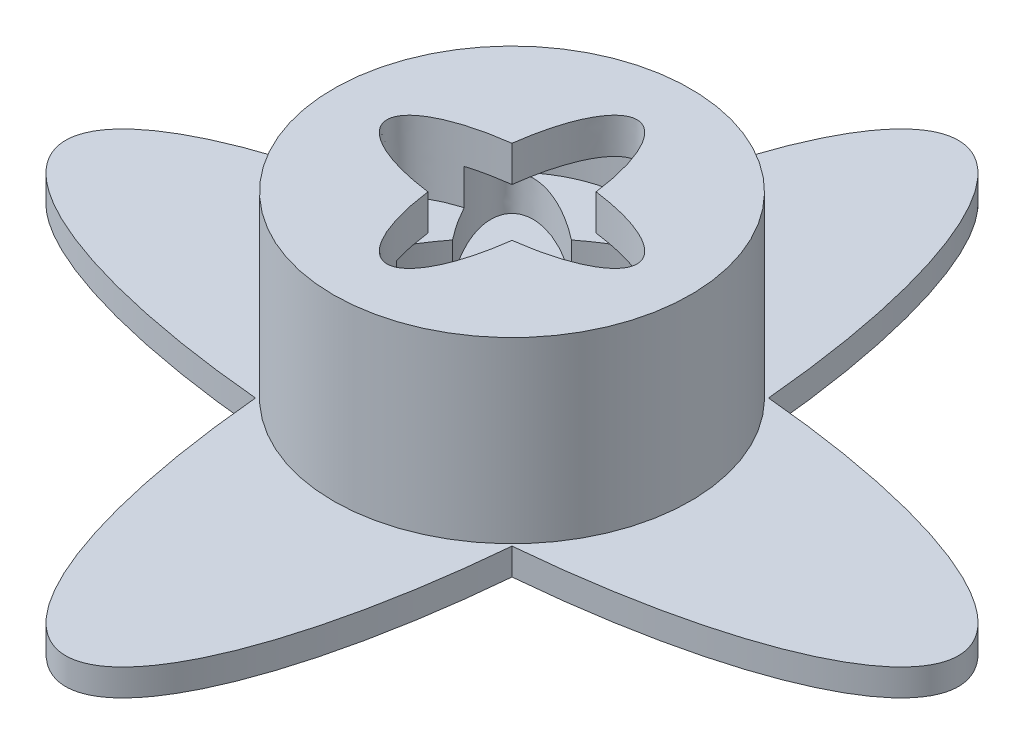
ISO-10303-21;
HEADER;
FILE_DESCRIPTION(('STEP AP214'),'2;1');
FILE_NAME('part.step','',(''),(''),'','','');
FILE_SCHEMA(('AUTOMOTIVE_DESIGN { 1 0 10303 214 1 1 1 1 }'));
ENDSEC;
DATA;
#1=APPLICATION_CONTEXT('core data for automotive mechanical design processes');
#2=APPLICATION_PROTOCOL_DEFINITION('international standard','automotive_design',2000,#1);
#3=PRODUCT_CONTEXT('',#1,'mechanical');
#4=PRODUCT('Part','Part','',(#3));
#5=PRODUCT_RELATED_PRODUCT_CATEGORY('part','',(#4));
#6=PRODUCT_DEFINITION_FORMATION('','',#4);
#7=PRODUCT_DEFINITION_CONTEXT('part definition',#1,'design');
#8=PRODUCT_DEFINITION('design','',#6,#7);
#9=PRODUCT_DEFINITION_SHAPE('','',#8);
#10=(LENGTH_UNIT() NAMED_UNIT(*) SI_UNIT(.MILLI.,.METRE.));
#11=(NAMED_UNIT(*) PLANE_ANGLE_UNIT() SI_UNIT($,.RADIAN.));
#12=(NAMED_UNIT(*) SI_UNIT($,.STERADIAN.) SOLID_ANGLE_UNIT());
#13=UNCERTAINTY_MEASURE_WITH_UNIT(LENGTH_MEASURE(1.E-05),#10,'distance_accuracy_value','');
#14=(GEOMETRIC_REPRESENTATION_CONTEXT(3) GLOBAL_UNCERTAINTY_ASSIGNED_CONTEXT((#13)) GLOBAL_UNIT_ASSIGNED_CONTEXT((#10,
#11,#12)) REPRESENTATION_CONTEXT('',''));
#15=CARTESIAN_POINT('',(0.,0.,0.));
#16=DIRECTION('',(0.,0.,1.));
#17=DIRECTION('',(1.,0.,0.));
#18=AXIS2_PLACEMENT_3D('',#15,#16,#17);
#19=CARTESIAN_POINT('',(0.,7.5,0.));
#20=DIRECTION('',(0.,1.,0.));
#21=DIRECTION('',(0.,0.,1.));
#22=AXIS2_PLACEMENT_3D('',#19,#20,#21);
#23=PLANE('',#22);
#24=CARTESIAN_POINT('',(0.,7.5,0.));
#25=DIRECTION('',(0.,1.,0.));
#26=DIRECTION('',(-0.707106781186544,0.,-0.707106781186551));
#27=AXIS2_PLACEMENT_3D('',#24,#25,#26);
#28=ELLIPSE('',#27,7.,2.5);
#29=CARTESIAN_POINT('',(4.57103403054583,7.5,1.89338428952106));
#30=VERTEX_POINT('',#29);
#31=CARTESIAN_POINT('',(3.32956045908145,7.5,0.));
#32=VERTEX_POINT('',#31);
#33=EDGE_CURVE('E11',#30,#32,#28,.T.);
#34=ORIENTED_EDGE('',*,*,#33,.F.);
#35=CARTESIAN_POINT('',(0.,7.5,0.));
#36=DIRECTION('',(0.,1.,0.));
#37=DIRECTION('',(-1.,0.,0.));
#38=AXIS2_PLACEMENT_3D('',#35,#36,#37);
#39=ELLIPSE('',#38,7.,2.5);
#40=CARTESIAN_POINT('',(7.,7.5,0.));
#41=VERTEX_POINT('',#40);
#42=EDGE_CURVE('E284',#30,#41,#39,.T.);
#43=ORIENTED_EDGE('',*,*,#42,.T.);
#44=CARTESIAN_POINT('',(0.,7.5,0.));
#45=DIRECTION('',(0.,1.,0.));
#46=DIRECTION('',(0.,0.,1.));
#47=AXIS2_PLACEMENT_3D('',#44,#45,#46);
#48=CIRCLE('',#47,7.);
#49=CARTESIAN_POINT('',(4.94974746830584,7.5,-4.94974746830583));
#50=VERTEX_POINT('',#49);
#51=EDGE_CURVE('E246',#41,#50,#48,.T.);
#52=ORIENTED_EDGE('',*,*,#51,.T.);
#53=CARTESIAN_POINT('',(0.,7.5,0.));
#54=DIRECTION('',(0.,1.,0.));
#55=DIRECTION('',(-0.707106781186549,0.,0.707106781186546));
#56=AXIS2_PLACEMENT_3D('',#53,#54,#55);
#57=ELLIPSE('',#56,7.,2.5);
#58=EDGE_CURVE('E232',#32,#50,#57,.T.);
#59=ORIENTED_EDGE('',*,*,#58,.F.);
#60=EDGE_LOOP('',(#34,#43,#52,#59));
#61=FACE_BOUND('',#60,.T.);
#62=ADVANCED_FACE('F33',(#61),#23,.T.);
#63=CARTESIAN_POINT('',(1.89338428952104,7.5,-4.57103403054583));
#64=VERTEX_POINT('',#63);
#65=CARTESIAN_POINT('',(0.,7.5,-3.32956045908146));
#66=VERTEX_POINT('',#65);
#67=EDGE_CURVE('E43',#64,#66,#57,.T.);
#68=ORIENTED_EDGE('',*,*,#67,.F.);
#69=CARTESIAN_POINT('',(0.,7.5,0.));
#70=DIRECTION('',(0.,1.,0.));
#71=DIRECTION('',(0.,0.,1.));
#72=AXIS2_PLACEMENT_3D('',#69,#70,#71);
#73=ELLIPSE('',#72,7.,2.5);
#74=CARTESIAN_POINT('',(0.,7.5,-7.));
#75=VERTEX_POINT('',#74);
#76=EDGE_CURVE('E280',#64,#75,#73,.T.);
#77=ORIENTED_EDGE('',*,*,#76,.T.);
#78=CARTESIAN_POINT('',(0.,7.5,0.));
#79=DIRECTION('',(0.,1.,0.));
#80=DIRECTION('',(0.,0.,1.));
#81=AXIS2_PLACEMENT_3D('',#78,#79,#80);
#82=CIRCLE('',#81,7.);
#83=CARTESIAN_POINT('',(-4.94974746830581,7.5,-4.94974746830586));
#84=VERTEX_POINT('',#83);
#85=EDGE_CURVE('E238',#75,#84,#82,.T.);
#86=ORIENTED_EDGE('',*,*,#85,.T.);
#87=CARTESIAN_POINT('',(0.,7.5,0.));
#88=DIRECTION('',(0.,1.,0.));
#89=DIRECTION('',(-0.707106781186544,0.,-0.707106781186551));
#90=AXIS2_PLACEMENT_3D('',#87,#88,#89);
#91=ELLIPSE('',#90,7.,2.5);
#92=EDGE_CURVE('E227',#66,#84,#91,.T.);
#93=ORIENTED_EDGE('',*,*,#92,.F.);
#94=EDGE_LOOP('',(#68,#77,#86,#93));
#95=FACE_BOUND('',#94,.T.);
#96=ADVANCED_FACE('F380',(#95),#23,.T.);
#97=CARTESIAN_POINT('',(-4.57103403054582,7.5,-1.89338428952106));
#98=VERTEX_POINT('',#97);
#99=CARTESIAN_POINT('',(-3.32956045908145,7.5,0.));
#100=VERTEX_POINT('',#99);
#101=EDGE_CURVE('E234',#98,#100,#91,.T.);
#102=ORIENTED_EDGE('',*,*,#101,.F.);
#103=CARTESIAN_POINT('',(0.,7.5,0.));
#104=DIRECTION('',(0.,1.,0.));
#105=DIRECTION('',(-1.,0.,0.));
#106=AXIS2_PLACEMENT_3D('',#103,#104,#105);
#107=ELLIPSE('',#106,7.,2.5);
#108=CARTESIAN_POINT('',(-7.,7.5,0.));
#109=VERTEX_POINT('',#108);
#110=EDGE_CURVE('E298',#98,#109,#107,.T.);
#111=ORIENTED_EDGE('',*,*,#110,.T.);
#112=CARTESIAN_POINT('',(0.,7.5,0.));
#113=DIRECTION('',(0.,1.,0.));
#114=DIRECTION('',(0.,0.,1.));
#115=AXIS2_PLACEMENT_3D('',#112,#113,#114);
#116=CIRCLE('',#115,7.);
#117=CARTESIAN_POINT('',(-4.94974746830584,7.5,4.94974746830582));
#118=VERTEX_POINT('',#117);
#119=EDGE_CURVE('E384',#109,#118,#116,.T.);
#120=ORIENTED_EDGE('',*,*,#119,.T.);
#121=CARTESIAN_POINT('',(0.,7.5,0.));
#122=DIRECTION('',(0.,1.,0.));
#123=DIRECTION('',(-0.707106781186549,0.,0.707106781186546));
#124=AXIS2_PLACEMENT_3D('',#121,#122,#123);
#125=ELLIPSE('',#124,7.,2.5);
#126=EDGE_CURVE('E225',#100,#118,#125,.T.);
#127=ORIENTED_EDGE('',*,*,#126,.F.);
#128=EDGE_LOOP('',(#102,#111,#120,#127));
#129=FACE_BOUND('',#128,.T.);
#130=ADVANCED_FACE('F270',(#129),#23,.T.);
#131=CARTESIAN_POINT('',(0.,1.5,0.));
#132=DIRECTION('',(0.,1.,0.));
#133=DIRECTION('',(-1.,0.,0.));
#134=AXIS2_PLACEMENT_3D('',#131,#132,#133);
#135=ELLIPSE('',#134,25.,7.5);
#136=DIRECTION('',(0.,-1.,0.));
#137=VECTOR('',#136,1.);
#138=SURFACE_OF_LINEAR_EXTRUSION('',#135,#137);
#139=CARTESIAN_POINT('',(0.,0.,0.));
#140=DIRECTION('',(0.,1.,0.));
#141=DIRECTION('',(-1.,0.,0.));
#142=AXIS2_PLACEMENT_3D('',#139,#140,#141);
#143=ELLIPSE('',#142,25.,7.5);
#144=CARTESIAN_POINT('',(7.18369713915863,0.,7.18369713915867));
#145=VERTEX_POINT('',#144);
#146=CARTESIAN_POINT('',(7.18369713915864,0.,-7.18369713915862));
#147=VERTEX_POINT('',#146);
#148=EDGE_CURVE('E316',#145,#147,#143,.T.);
#149=ORIENTED_EDGE('',*,*,#148,.T.);
#150=DIRECTION('',(0.,-1.,0.));
#151=VECTOR('',#150,1.);
#152=CARTESIAN_POINT('',(7.18369713915864,1.5,-7.18369713915862));
#153=LINE('',#152,#151);
#154=CARTESIAN_POINT('',(7.18369713915864,1.5,-7.18369713915862));
#155=VERTEX_POINT('',#154);
#156=EDGE_CURVE('E362',#155,#147,#153,.T.);
#157=ORIENTED_EDGE('',*,*,#156,.F.);
#158=CARTESIAN_POINT('',(7.18369713915863,1.5,7.18369713915867));
#159=VERTEX_POINT('',#158);
#160=EDGE_CURVE('E318',#159,#155,#135,.T.);
#161=ORIENTED_EDGE('',*,*,#160,.F.);
#162=DIRECTION('',(0.,-1.,0.));
#163=VECTOR('',#162,1.);
#164=CARTESIAN_POINT('',(7.18369713915863,1.5,7.18369713915867));
#165=LINE('',#164,#163);
#166=EDGE_CURVE('E347',#159,#145,#165,.T.);
#167=ORIENTED_EDGE('',*,*,#166,.T.);
#168=EDGE_LOOP('',(#149,#157,#161,#167));
#169=FACE_BOUND('',#168,.T.);
#170=ADVANCED_FACE('F35',(#169),#138,.F.);
#171=CARTESIAN_POINT('',(0.,1.5,0.));
#172=DIRECTION('',(0.,1.,0.));
#173=DIRECTION('',(0.,0.,1.));
#174=AXIS2_PLACEMENT_3D('',#171,#172,#173);
#175=ELLIPSE('',#174,25.,7.5);
#176=DIRECTION('',(0.,-1.,0.));
#177=VECTOR('',#176,1.);
#178=SURFACE_OF_LINEAR_EXTRUSION('',#175,#177);
#179=CARTESIAN_POINT('',(0.,0.,0.));
#180=DIRECTION('',(0.,1.,0.));
#181=DIRECTION('',(0.,0.,1.));
#182=AXIS2_PLACEMENT_3D('',#179,#180,#181);
#183=ELLIPSE('',#182,25.,7.5);
#184=CARTESIAN_POINT('',(-7.18369713915862,0.,-7.18369713915866));
#185=VERTEX_POINT('',#184);
#186=EDGE_CURVE('E350',#147,#185,#183,.T.);
#187=ORIENTED_EDGE('',*,*,#186,.T.);
#188=DIRECTION('',(0.,-1.,0.));
#189=VECTOR('',#188,1.);
#190=CARTESIAN_POINT('',(-7.18369713915862,1.5,-7.18369713915866));
#191=LINE('',#190,#189);
#192=CARTESIAN_POINT('',(-7.18369713915862,1.5,-7.18369713915866));
#193=VERTEX_POINT('',#192);
#194=EDGE_CURVE('E360',#193,#185,#191,.T.);
#195=ORIENTED_EDGE('',*,*,#194,.F.);
#196=EDGE_CURVE('E322',#155,#193,#175,.T.);
#197=ORIENTED_EDGE('',*,*,#196,.F.);
#198=ORIENTED_EDGE('',*,*,#156,.T.);
#199=EDGE_LOOP('',(#187,#195,#197,#198));
#200=FACE_BOUND('',#199,.T.);
#201=ADVANCED_FACE('F329',(#200),#178,.F.);
#202=CARTESIAN_POINT('',(0.,1.5,0.));
#203=DIRECTION('',(0.,1.,0.));
#204=DIRECTION('',(-1.,0.,0.));
#205=AXIS2_PLACEMENT_3D('',#202,#203,#204);
#206=ELLIPSE('',#205,25.,7.5);
#207=DIRECTION('',(0.,-1.,0.));
#208=VECTOR('',#207,1.);
#209=SURFACE_OF_LINEAR_EXTRUSION('',#206,#208);
#210=CARTESIAN_POINT('',(0.,0.,0.));
#211=DIRECTION('',(0.,1.,0.));
#212=DIRECTION('',(-1.,0.,0.));
#213=AXIS2_PLACEMENT_3D('',#210,#211,#212);
#214=ELLIPSE('',#213,25.,7.5);
#215=CARTESIAN_POINT('',(-7.18369713915864,0.,7.1836971391586));
#216=VERTEX_POINT('',#215);
#217=EDGE_CURVE('E352',#185,#216,#214,.T.);
#218=ORIENTED_EDGE('',*,*,#217,.T.);
#219=DIRECTION('',(0.,-1.,0.));
#220=VECTOR('',#219,1.);
#221=CARTESIAN_POINT('',(-7.18369713915864,1.5,7.1836971391586));
#222=LINE('',#221,#220);
#223=CARTESIAN_POINT('',(-7.18369713915864,1.5,7.1836971391586));
#224=VERTEX_POINT('',#223);
#225=EDGE_CURVE('E357',#224,#216,#222,.T.);
#226=ORIENTED_EDGE('',*,*,#225,.F.);
#227=EDGE_CURVE('E326',#193,#224,#206,.T.);
#228=ORIENTED_EDGE('',*,*,#227,.F.);
#229=ORIENTED_EDGE('',*,*,#194,.T.);
#230=EDGE_LOOP('',(#218,#226,#228,#229));
#231=FACE_BOUND('',#230,.T.);
#232=ADVANCED_FACE('F332',(#231),#209,.F.);
#233=CARTESIAN_POINT('',(0.,1.5,0.));
#234=DIRECTION('',(0.,1.,0.));
#235=DIRECTION('',(0.,0.,1.));
#236=AXIS2_PLACEMENT_3D('',#233,#234,#235);
#237=ELLIPSE('',#236,25.,7.5);
#238=DIRECTION('',(0.,-1.,0.));
#239=VECTOR('',#238,1.);
#240=SURFACE_OF_LINEAR_EXTRUSION('',#237,#239);
#241=CARTESIAN_POINT('',(0.,0.,0.));
#242=DIRECTION('',(0.,1.,0.));
#243=DIRECTION('',(0.,0.,1.));
#244=AXIS2_PLACEMENT_3D('',#241,#242,#243);
#245=ELLIPSE('',#244,25.,7.5);
#246=EDGE_CURVE('E323',#216,#145,#245,.T.);
#247=ORIENTED_EDGE('',*,*,#246,.T.);
#248=ORIENTED_EDGE('',*,*,#166,.F.);
#249=EDGE_CURVE('E344',#224,#159,#237,.T.);
#250=ORIENTED_EDGE('',*,*,#249,.F.);
#251=ORIENTED_EDGE('',*,*,#225,.T.);
#252=EDGE_LOOP('',(#247,#248,#250,#251));
#253=FACE_BOUND('',#252,.T.);
#254=ADVANCED_FACE('F336',(#253),#240,.F.);
#255=CARTESIAN_POINT('',(0.,1.5,0.));
#256=DIRECTION('',(0.,1.,0.));
#257=DIRECTION('',(0.,0.,1.));
#258=AXIS2_PLACEMENT_3D('',#255,#256,#257);
#259=PLANE('',#258);
#260=CARTESIAN_POINT('',(0.,1.5,0.));
#261=DIRECTION('',(0.,1.,0.));
#262=DIRECTION('',(0.,0.,1.));
#263=AXIS2_PLACEMENT_3D('',#260,#261,#262);
#264=CIRCLE('',#263,10.);
#265=CARTESIAN_POINT('',(0.,1.5,10.));
#266=VERTEX_POINT('',#265);
#267=EDGE_CURVE('E310',#266,#266,#264,.T.);
#268=ORIENTED_EDGE('',*,*,#267,.F.);
#269=EDGE_LOOP('',(#268));
#270=FACE_BOUND('',#269,.T.);
#271=ORIENTED_EDGE('',*,*,#160,.T.);
#272=ORIENTED_EDGE('',*,*,#196,.T.);
#273=ORIENTED_EDGE('',*,*,#227,.T.);
#274=ORIENTED_EDGE('',*,*,#249,.T.);
#275=EDGE_LOOP('',(#271,#272,#273,#274));
#276=FACE_BOUND('',#275,.T.);
#277=ADVANCED_FACE('F340',(#270,#276),#259,.T.);
#278=CARTESIAN_POINT('',(0.,0.,0.));
#279=DIRECTION('',(0.,1.,0.));
#280=DIRECTION('',(0.,0.,1.));
#281=AXIS2_PLACEMENT_3D('',#278,#279,#280);
#282=PLANE('',#281);
#283=CARTESIAN_POINT('',(0.,0.,0.));
#284=DIRECTION('',(0.,-1.,0.));
#285=DIRECTION('',(0.,0.,-1.));
#286=AXIS2_PLACEMENT_3D('',#283,#284,#285);
#287=CIRCLE('',#286,2.5);
#288=CARTESIAN_POINT('',(0.,0.,-2.5));
#289=VERTEX_POINT('',#288);
#290=EDGE_CURVE('E301',#289,#289,#287,.T.);
#291=ORIENTED_EDGE('',*,*,#290,.F.);
#292=EDGE_LOOP('',(#291));
#293=FACE_BOUND('',#292,.T.);
#294=ORIENTED_EDGE('',*,*,#148,.F.);
#295=ORIENTED_EDGE('',*,*,#246,.F.);
#296=ORIENTED_EDGE('',*,*,#217,.F.);
#297=ORIENTED_EDGE('',*,*,#186,.F.);
#298=EDGE_LOOP('',(#294,#295,#296,#297));
#299=FACE_BOUND('',#298,.T.);
#300=ADVANCED_FACE('F342',(#293,#299),#282,.F.);
#301=CARTESIAN_POINT('',(0.,11.5,0.));
#302=DIRECTION('',(0.,-1.,0.));
#303=DIRECTION('',(0.,0.,-1.));
#304=AXIS2_PLACEMENT_3D('',#301,#302,#303);
#305=CYLINDRICAL_SURFACE('',#304,10.);
#306=CARTESIAN_POINT('',(0.,11.5,0.));
#307=DIRECTION('',(0.,1.,0.));
#308=DIRECTION('',(0.,0.,1.));
#309=AXIS2_PLACEMENT_3D('',#306,#307,#308);
#310=CIRCLE('',#309,10.);
#311=CARTESIAN_POINT('',(0.,11.5,10.));
#312=VERTEX_POINT('',#311);
#313=EDGE_CURVE('E313',#312,#312,#310,.T.);
#314=ORIENTED_EDGE('',*,*,#313,.F.);
#315=EDGE_LOOP('',(#314));
#316=FACE_BOUND('',#315,.T.);
#317=ORIENTED_EDGE('',*,*,#267,.T.);
#318=EDGE_LOOP('',(#317));
#319=FACE_BOUND('',#318,.T.);
#320=ADVANCED_FACE('F426',(#316,#319),#305,.T.);
#321=CARTESIAN_POINT('',(0.,11.5,0.));
#322=DIRECTION('',(0.,1.,0.));
#323=DIRECTION('',(0.,0.,1.));
#324=AXIS2_PLACEMENT_3D('',#321,#322,#323);
#325=PLANE('',#324);
#326=CARTESIAN_POINT('',(0.,11.5,0.));
#327=DIRECTION('',(0.,1.,0.));
#328=DIRECTION('',(-1.,0.,0.));
#329=AXIS2_PLACEMENT_3D('',#326,#327,#328);
#330=ELLIPSE('',#329,7.,2.5);
#331=CARTESIAN_POINT('',(-2.35435477898709,11.5,-2.3543547789871));
#332=VERTEX_POINT('',#331);
#333=CARTESIAN_POINT('',(-2.3543547789871,11.5,2.35435477898708));
#334=VERTEX_POINT('',#333);
#335=EDGE_CURVE('E287',#332,#334,#330,.T.);
#336=ORIENTED_EDGE('',*,*,#335,.F.);
#337=CARTESIAN_POINT('',(0.,11.5,0.));
#338=DIRECTION('',(0.,1.,0.));
#339=DIRECTION('',(0.,0.,1.));
#340=AXIS2_PLACEMENT_3D('',#337,#338,#339);
#341=ELLIPSE('',#340,7.,2.5);
#342=CARTESIAN_POINT('',(2.3543547789871,11.5,-2.35435477898709));
#343=VERTEX_POINT('',#342);
#344=EDGE_CURVE('E295',#343,#332,#341,.T.);
#345=ORIENTED_EDGE('',*,*,#344,.F.);
#346=CARTESIAN_POINT('',(0.,11.5,0.));
#347=DIRECTION('',(0.,1.,0.));
#348=DIRECTION('',(-1.,0.,0.));
#349=AXIS2_PLACEMENT_3D('',#346,#347,#348);
#350=ELLIPSE('',#349,7.,2.5);
#351=CARTESIAN_POINT('',(2.35435477898709,11.5,2.3543547789871));
#352=VERTEX_POINT('',#351);
#353=EDGE_CURVE('E292',#352,#343,#350,.T.);
#354=ORIENTED_EDGE('',*,*,#353,.F.);
#355=CARTESIAN_POINT('',(0.,11.5,0.));
#356=DIRECTION('',(0.,1.,0.));
#357=DIRECTION('',(0.,0.,1.));
#358=AXIS2_PLACEMENT_3D('',#355,#356,#357);
#359=ELLIPSE('',#358,7.,2.5);
#360=EDGE_CURVE('E289',#334,#352,#359,.T.);
#361=ORIENTED_EDGE('',*,*,#360,.F.);
#362=EDGE_LOOP('',(#336,#345,#354,#361));
#363=FACE_BOUND('',#362,.T.);
#364=ORIENTED_EDGE('',*,*,#313,.T.);
#365=EDGE_LOOP('',(#364));
#366=FACE_BOUND('',#365,.T.);
#367=ADVANCED_FACE('F422',(#363,#366),#325,.T.);
#368=CARTESIAN_POINT('',(0.,2.5,0.));
#369=DIRECTION('',(0.,-1.,0.));
#370=DIRECTION('',(0.,0.,-1.));
#371=AXIS2_PLACEMENT_3D('',#368,#369,#370);
#372=CYLINDRICAL_SURFACE('',#371,2.5);
#373=CARTESIAN_POINT('',(0.,2.5,0.));
#374=DIRECTION('',(0.,-1.,0.));
#375=DIRECTION('',(0.,0.,-1.));
#376=AXIS2_PLACEMENT_3D('',#373,#374,#375);
#377=CIRCLE('',#376,2.5);
#378=CARTESIAN_POINT('',(0.,2.5,-2.5));
#379=VERTEX_POINT('',#378);
#380=EDGE_CURVE('E307',#379,#379,#377,.T.);
#381=ORIENTED_EDGE('',*,*,#380,.F.);
#382=EDGE_LOOP('',(#381));
#383=FACE_BOUND('',#382,.T.);
#384=ORIENTED_EDGE('',*,*,#290,.T.);
#385=EDGE_LOOP('',(#384));
#386=FACE_BOUND('',#385,.T.);
#387=ADVANCED_FACE('F418',(#383,#386),#372,.F.);
#388=CARTESIAN_POINT('',(0.,2.5,0.));
#389=DIRECTION('',(0.,-1.,0.));
#390=DIRECTION('',(0.,0.,-1.));
#391=AXIS2_PLACEMENT_3D('',#388,#389,#390);
#392=PLANE('',#391);
#393=ORIENTED_EDGE('',*,*,#380,.T.);
#394=EDGE_LOOP('',(#393));
#395=FACE_BOUND('',#394,.T.);
#396=ADVANCED_FACE('F414',(#395),#392,.T.);
#397=DIRECTION('',(0.,1.,0.));
#398=VECTOR('',#397,1.);
#399=SURFACE_OF_LINEAR_EXTRUSION('',#107,#398);
#400=CARTESIAN_POINT('',(0.,9.5,0.));
#401=DIRECTION('',(0.,1.,0.));
#402=DIRECTION('',(-1.,0.,0.));
#403=AXIS2_PLACEMENT_3D('',#400,#401,#402);
#404=ELLIPSE('',#403,7.,2.5);
#405=CARTESIAN_POINT('',(-2.3543547789871,9.5,2.35435477898708));
#406=VERTEX_POINT('',#405);
#407=CARTESIAN_POINT('',(-7.,9.5,0.));
#408=VERTEX_POINT('',#407);
#409=EDGE_CURVE('E399',#406,#408,#404,.F.);
#410=ORIENTED_EDGE('',*,*,#409,.T.);
#411=DIRECTION('',(0.,-1.,0.));
#412=VECTOR('',#411,1.);
#413=CARTESIAN_POINT('',(-7.,9.5,0.));
#414=LINE('',#413,#412);
#415=EDGE_CURVE('E393',#408,#109,#414,.T.);
#416=ORIENTED_EDGE('',*,*,#415,.T.);
#417=ORIENTED_EDGE('',*,*,#110,.F.);
#418=DIRECTION('',(0.,-1.,0.));
#419=VECTOR('',#418,1.);
#420=CARTESIAN_POINT('',(-4.57103403054583,9.5,-1.89338428952106));
#421=LINE('',#420,#419);
#422=CARTESIAN_POINT('',(-4.57103403054583,9.5,-1.89338428952106));
#423=VERTEX_POINT('',#422);
#424=EDGE_CURVE('E389',#423,#98,#421,.T.);
#425=ORIENTED_EDGE('',*,*,#424,.F.);
#426=CARTESIAN_POINT('',(-2.35435477898709,9.5,-2.3543547789871));
#427=VERTEX_POINT('',#426);
#428=EDGE_CURVE('E290',#423,#427,#404,.F.);
#429=ORIENTED_EDGE('',*,*,#428,.T.);
#430=DIRECTION('',(0.,1.,0.));
#431=VECTOR('',#430,1.);
#432=CARTESIAN_POINT('',(-2.35435477898709,7.5,-2.3543547789871));
#433=LINE('',#432,#431);
#434=EDGE_CURVE('E299',#427,#332,#433,.T.);
#435=ORIENTED_EDGE('',*,*,#434,.T.);
#436=ORIENTED_EDGE('',*,*,#335,.T.);
#437=DIRECTION('',(0.,1.,0.));
#438=VECTOR('',#437,1.);
#439=CARTESIAN_POINT('',(-2.3543547789871,7.5,2.35435477898708));
#440=LINE('',#439,#438);
#441=EDGE_CURVE('E60',#406,#334,#440,.T.);
#442=ORIENTED_EDGE('',*,*,#441,.F.);
#443=EDGE_LOOP('',(#410,#416,#417,#425,#429,#435,#436,#442));
#444=FACE_BOUND('',#443,.T.);
#445=ADVANCED_FACE('F276',(#444),#399,.F.);
#446=DIRECTION('',(0.,1.,0.));
#447=VECTOR('',#446,1.);
#448=SURFACE_OF_LINEAR_EXTRUSION('',#73,#447);
#449=ORIENTED_EDGE('',*,*,#434,.F.);
#450=CARTESIAN_POINT('',(0.,9.5,0.));
#451=DIRECTION('',(0.,1.,0.));
#452=DIRECTION('',(0.,0.,1.));
#453=AXIS2_PLACEMENT_3D('',#450,#451,#452);
#454=ELLIPSE('',#453,7.,2.5);
#455=CARTESIAN_POINT('',(0.,9.5,-7.));
#456=VERTEX_POINT('',#455);
#457=EDGE_CURVE('E406',#427,#456,#454,.F.);
#458=ORIENTED_EDGE('',*,*,#457,.T.);
#459=DIRECTION('',(0.,-1.,0.));
#460=VECTOR('',#459,1.);
#461=CARTESIAN_POINT('',(0.,9.5,-7.));
#462=LINE('',#461,#460);
#463=EDGE_CURVE('E388',#456,#75,#462,.T.);
#464=ORIENTED_EDGE('',*,*,#463,.T.);
#465=ORIENTED_EDGE('',*,*,#76,.F.);
#466=DIRECTION('',(0.,-1.,0.));
#467=VECTOR('',#466,1.);
#468=CARTESIAN_POINT('',(1.89338428952104,9.5,-4.57103403054583));
#469=LINE('',#468,#467);
#470=CARTESIAN_POINT('',(1.89338428952104,9.5,-4.57103403054583));
#471=VERTEX_POINT('',#470);
#472=EDGE_CURVE('E374',#471,#64,#469,.T.);
#473=ORIENTED_EDGE('',*,*,#472,.F.);
#474=CARTESIAN_POINT('',(2.3543547789871,9.5,-2.35435477898709));
#475=VERTEX_POINT('',#474);
#476=EDGE_CURVE('E403',#471,#475,#454,.F.);
#477=ORIENTED_EDGE('',*,*,#476,.T.);
#478=DIRECTION('',(0.,1.,0.));
#479=VECTOR('',#478,1.);
#480=CARTESIAN_POINT('',(2.3543547789871,7.5,-2.35435477898709));
#481=LINE('',#480,#479);
#482=EDGE_CURVE('E302',#475,#343,#481,.T.);
#483=ORIENTED_EDGE('',*,*,#482,.T.);
#484=ORIENTED_EDGE('',*,*,#344,.T.);
#485=EDGE_LOOP('',(#449,#458,#464,#465,#473,#477,#483,#484));
#486=FACE_BOUND('',#485,.T.);
#487=ADVANCED_FACE('F271',(#486),#448,.F.);
#488=DIRECTION('',(0.,1.,0.));
#489=VECTOR('',#488,1.);
#490=SURFACE_OF_LINEAR_EXTRUSION('',#39,#489);
#491=ORIENTED_EDGE('',*,*,#482,.F.);
#492=CARTESIAN_POINT('',(0.,9.5,0.));
#493=DIRECTION('',(0.,1.,0.));
#494=DIRECTION('',(-1.,0.,0.));
#495=AXIS2_PLACEMENT_3D('',#492,#493,#494);
#496=ELLIPSE('',#495,7.,2.5);
#497=CARTESIAN_POINT('',(7.,9.5,0.));
#498=VERTEX_POINT('',#497);
#499=EDGE_CURVE('E400',#475,#498,#496,.F.);
#500=ORIENTED_EDGE('',*,*,#499,.T.);
#501=DIRECTION('',(0.,-1.,0.));
#502=VECTOR('',#501,1.);
#503=CARTESIAN_POINT('',(7.,9.5,0.));
#504=LINE('',#503,#502);
#505=EDGE_CURVE('E454',#498,#41,#504,.T.);
#506=ORIENTED_EDGE('',*,*,#505,.T.);
#507=ORIENTED_EDGE('',*,*,#42,.F.);
#508=DIRECTION('',(0.,-1.,0.));
#509=VECTOR('',#508,1.);
#510=CARTESIAN_POINT('',(4.57103403054583,9.5,1.89338428952106));
#511=LINE('',#510,#509);
#512=CARTESIAN_POINT('',(4.57103403054583,9.5,1.89338428952106));
#513=VERTEX_POINT('',#512);
#514=EDGE_CURVE('E448',#513,#30,#511,.T.);
#515=ORIENTED_EDGE('',*,*,#514,.F.);
#516=CARTESIAN_POINT('',(2.35435477898709,9.5,2.3543547789871));
#517=VERTEX_POINT('',#516);
#518=EDGE_CURVE('E391',#513,#517,#496,.F.);
#519=ORIENTED_EDGE('',*,*,#518,.T.);
#520=DIRECTION('',(0.,1.,0.));
#521=VECTOR('',#520,1.);
#522=CARTESIAN_POINT('',(2.35435477898709,7.5,2.3543547789871));
#523=LINE('',#522,#521);
#524=EDGE_CURVE('E304',#517,#352,#523,.T.);
#525=ORIENTED_EDGE('',*,*,#524,.T.);
#526=ORIENTED_EDGE('',*,*,#353,.T.);
#527=EDGE_LOOP('',(#491,#500,#506,#507,#515,#519,#525,#526));
#528=FACE_BOUND('',#527,.T.);
#529=ADVANCED_FACE('F275',(#528),#490,.F.);
#530=CARTESIAN_POINT('',(0.,7.5,0.));
#531=DIRECTION('',(0.,1.,0.));
#532=DIRECTION('',(0.,0.,1.));
#533=AXIS2_PLACEMENT_3D('',#530,#531,#532);
#534=ELLIPSE('',#533,7.,2.5);
#535=DIRECTION('',(0.,1.,0.));
#536=VECTOR('',#535,1.);
#537=SURFACE_OF_LINEAR_EXTRUSION('',#534,#536);
#538=CARTESIAN_POINT('',(0.,9.5,0.));
#539=DIRECTION('',(0.,1.,0.));
#540=DIRECTION('',(0.,0.,1.));
#541=AXIS2_PLACEMENT_3D('',#538,#539,#540);
#542=ELLIPSE('',#541,7.,2.5);
#543=CARTESIAN_POINT('',(0.,9.5,7.));
#544=VERTEX_POINT('',#543);
#545=EDGE_CURVE('E38',#517,#544,#542,.F.);
#546=ORIENTED_EDGE('',*,*,#545,.T.);
#547=DIRECTION('',(0.,-1.,0.));
#548=VECTOR('',#547,1.);
#549=CARTESIAN_POINT('',(0.,9.5,7.));
#550=LINE('',#549,#548);
#551=CARTESIAN_POINT('',(0.,7.5,7.));
#552=VERTEX_POINT('',#551);
#553=EDGE_CURVE('E464',#544,#552,#550,.T.);
#554=ORIENTED_EDGE('',*,*,#553,.T.);
#555=CARTESIAN_POINT('',(-1.89338428952104,7.5,4.57103403054583));
#556=VERTEX_POINT('',#555);
#557=EDGE_CURVE('E409',#556,#552,#534,.T.);
#558=ORIENTED_EDGE('',*,*,#557,.F.);
#559=DIRECTION('',(0.,-1.,0.));
#560=VECTOR('',#559,1.);
#561=CARTESIAN_POINT('',(-1.89338428952104,9.5,4.57103403054583));
#562=LINE('',#561,#560);
#563=CARTESIAN_POINT('',(-1.89338428952104,9.5,4.57103403054583));
#564=VERTEX_POINT('',#563);
#565=EDGE_CURVE('E463',#564,#556,#562,.T.);
#566=ORIENTED_EDGE('',*,*,#565,.F.);
#567=EDGE_CURVE('E366',#564,#406,#542,.F.);
#568=ORIENTED_EDGE('',*,*,#567,.T.);
#569=ORIENTED_EDGE('',*,*,#441,.T.);
#570=ORIENTED_EDGE('',*,*,#360,.T.);
#571=ORIENTED_EDGE('',*,*,#524,.F.);
#572=EDGE_LOOP('',(#546,#554,#558,#566,#568,#569,#570,#571));
#573=FACE_BOUND('',#572,.T.);
#574=ADVANCED_FACE('F269',(#573),#537,.F.);
#575=CARTESIAN_POINT('',(0.,7.5,3.32956045908146));
#576=VERTEX_POINT('',#575);
#577=CARTESIAN_POINT('',(4.94974746830581,7.5,4.94974746830586));
#578=VERTEX_POINT('',#577);
#579=EDGE_CURVE('E45',#576,#578,#28,.T.);
#580=ORIENTED_EDGE('',*,*,#579,.F.);
#581=EDGE_CURVE('E52',#556,#576,#125,.T.);
#582=ORIENTED_EDGE('',*,*,#581,.F.);
#583=ORIENTED_EDGE('',*,*,#557,.T.);
#584=CARTESIAN_POINT('',(0.,7.5,0.));
#585=DIRECTION('',(0.,1.,0.));
#586=DIRECTION('',(0.,0.,1.));
#587=AXIS2_PLACEMENT_3D('',#584,#585,#586);
#588=CIRCLE('',#587,7.);
#589=EDGE_CURVE('E461',#552,#578,#588,.T.);
#590=ORIENTED_EDGE('',*,*,#589,.T.);
#591=EDGE_LOOP('',(#580,#582,#583,#590));
#592=FACE_BOUND('',#591,.T.);
#593=ADVANCED_FACE('F265',(#592),#23,.T.);
#594=CARTESIAN_POINT('',(0.,9.5,0.));
#595=DIRECTION('',(0.,1.,0.));
#596=DIRECTION('',(0.,0.,1.));
#597=AXIS2_PLACEMENT_3D('',#594,#595,#596);
#598=PLANE('',#597);
#599=CARTESIAN_POINT('',(0.,9.5,0.));
#600=DIRECTION('',(0.,1.,0.));
#601=DIRECTION('',(-0.707106781186544,0.,-0.707106781186551));
#602=AXIS2_PLACEMENT_3D('',#599,#600,#601);
#603=ELLIPSE('',#602,7.,2.5);
#604=CARTESIAN_POINT('',(4.94974746830581,9.5,4.94974746830586));
#605=VERTEX_POINT('',#604);
#606=EDGE_CURVE('E451',#605,#513,#603,.T.);
#607=ORIENTED_EDGE('',*,*,#606,.F.);
#608=CARTESIAN_POINT('',(0.,9.5,0.));
#609=DIRECTION('',(0.,1.,0.));
#610=DIRECTION('',(0.,0.,1.));
#611=AXIS2_PLACEMENT_3D('',#608,#609,#610);
#612=CIRCLE('',#611,7.);
#613=EDGE_CURVE('E491',#544,#605,#612,.T.);
#614=ORIENTED_EDGE('',*,*,#613,.F.);
#615=ORIENTED_EDGE('',*,*,#545,.F.);
#616=ORIENTED_EDGE('',*,*,#518,.F.);
#617=EDGE_LOOP('',(#607,#614,#615,#616));
#618=FACE_BOUND('',#617,.T.);
#619=ADVANCED_FACE('F268',(#618),#598,.F.);
#620=CARTESIAN_POINT('',(0.,9.5,0.));
#621=DIRECTION('',(0.,-1.,0.));
#622=DIRECTION('',(0.,0.,-1.));
#623=AXIS2_PLACEMENT_3D('',#620,#621,#622);
#624=CYLINDRICAL_SURFACE('',#623,7.);
#625=ORIENTED_EDGE('',*,*,#589,.F.);
#626=ORIENTED_EDGE('',*,*,#553,.F.);
#627=ORIENTED_EDGE('',*,*,#613,.T.);
#628=DIRECTION('',(0.,-1.,0.));
#629=VECTOR('',#628,1.);
#630=CARTESIAN_POINT('',(4.94974746830581,9.5,4.94974746830586));
#631=LINE('',#630,#629);
#632=EDGE_CURVE('E453',#605,#578,#631,.T.);
#633=ORIENTED_EDGE('',*,*,#632,.T.);
#634=EDGE_LOOP('',(#625,#626,#627,#633));
#635=FACE_BOUND('',#634,.T.);
#636=ADVANCED_FACE('F506',(#635),#624,.F.);
#637=DIRECTION('',(0.,-1.,0.));
#638=VECTOR('',#637,1.);
#639=SURFACE_OF_LINEAR_EXTRUSION('',#603,#638);
#640=ORIENTED_EDGE('',*,*,#514,.T.);
#641=ORIENTED_EDGE('',*,*,#33,.T.);
#642=DIRECTION('',(0.,1.,0.));
#643=VECTOR('',#642,1.);
#644=CARTESIAN_POINT('',(3.32956045908145,5.5,0.));
#645=LINE('',#644,#643);
#646=CARTESIAN_POINT('',(3.32956045908145,5.5,0.));
#647=VERTEX_POINT('',#646);
#648=EDGE_CURVE('E200',#647,#32,#645,.T.);
#649=ORIENTED_EDGE('',*,*,#648,.F.);
#650=CARTESIAN_POINT('',(0.,5.5,0.));
#651=DIRECTION('',(0.,1.,0.));
#652=DIRECTION('',(-0.707106781186544,0.,-0.707106781186551));
#653=AXIS2_PLACEMENT_3D('',#650,#651,#652);
#654=ELLIPSE('',#653,7.,2.5);
#655=CARTESIAN_POINT('',(0.,5.5,3.32956045908146));
#656=VERTEX_POINT('',#655);
#657=EDGE_CURVE('E206',#656,#647,#654,.T.);
#658=ORIENTED_EDGE('',*,*,#657,.F.);
#659=DIRECTION('',(0.,1.,0.));
#660=VECTOR('',#659,1.);
#661=CARTESIAN_POINT('',(0.,5.5,3.32956045908146));
#662=LINE('',#661,#660);
#663=EDGE_CURVE('E236',#656,#576,#662,.T.);
#664=ORIENTED_EDGE('',*,*,#663,.T.);
#665=ORIENTED_EDGE('',*,*,#579,.T.);
#666=ORIENTED_EDGE('',*,*,#632,.F.);
#667=ORIENTED_EDGE('',*,*,#606,.T.);
#668=EDGE_LOOP('',(#640,#641,#649,#658,#664,#665,#666,#667));
#669=FACE_BOUND('',#668,.T.);
#670=ADVANCED_FACE('F203',(#669),#639,.T.);
#671=ORIENTED_EDGE('',*,*,#567,.F.);
#672=CARTESIAN_POINT('',(0.,9.5,0.));
#673=DIRECTION('',(0.,1.,0.));
#674=DIRECTION('',(-0.707106781186549,0.,0.707106781186546));
#675=AXIS2_PLACEMENT_3D('',#672,#673,#674);
#676=ELLIPSE('',#675,7.,2.5);
#677=CARTESIAN_POINT('',(-4.94974746830584,9.5,4.94974746830582));
#678=VERTEX_POINT('',#677);
#679=EDGE_CURVE('E492',#678,#564,#676,.T.);
#680=ORIENTED_EDGE('',*,*,#679,.F.);
#681=CARTESIAN_POINT('',(0.,9.5,0.));
#682=DIRECTION('',(0.,1.,0.));
#683=DIRECTION('',(0.,0.,1.));
#684=AXIS2_PLACEMENT_3D('',#681,#682,#683);
#685=CIRCLE('',#684,7.);
#686=EDGE_CURVE('E250',#408,#678,#685,.T.);
#687=ORIENTED_EDGE('',*,*,#686,.F.);
#688=ORIENTED_EDGE('',*,*,#409,.F.);
#689=EDGE_LOOP('',(#671,#680,#687,#688));
#690=FACE_BOUND('',#689,.T.);
#691=ADVANCED_FACE('F505',(#690),#598,.F.);
#692=DIRECTION('',(0.,-1.,0.));
#693=VECTOR('',#692,1.);
#694=SURFACE_OF_LINEAR_EXTRUSION('',#676,#693);
#695=ORIENTED_EDGE('',*,*,#565,.T.);
#696=ORIENTED_EDGE('',*,*,#581,.T.);
#697=ORIENTED_EDGE('',*,*,#663,.F.);
#698=CARTESIAN_POINT('',(0.,5.5,0.));
#699=DIRECTION('',(0.,1.,0.));
#700=DIRECTION('',(-0.707106781186549,0.,0.707106781186546));
#701=AXIS2_PLACEMENT_3D('',#698,#699,#700);
#702=ELLIPSE('',#701,7.,2.5);
#703=CARTESIAN_POINT('',(-3.32956045908145,5.5,0.));
#704=VERTEX_POINT('',#703);
#705=EDGE_CURVE('E211',#704,#656,#702,.T.);
#706=ORIENTED_EDGE('',*,*,#705,.F.);
#707=DIRECTION('',(0.,1.,0.));
#708=VECTOR('',#707,1.);
#709=CARTESIAN_POINT('',(-3.32956045908145,5.5,0.));
#710=LINE('',#709,#708);
#711=EDGE_CURVE('E239',#704,#100,#710,.T.);
#712=ORIENTED_EDGE('',*,*,#711,.T.);
#713=ORIENTED_EDGE('',*,*,#126,.T.);
#714=DIRECTION('',(0.,-1.,0.));
#715=VECTOR('',#714,1.);
#716=CARTESIAN_POINT('',(-4.94974746830584,9.5,4.94974746830582));
#717=LINE('',#716,#715);
#718=EDGE_CURVE('E468',#678,#118,#717,.T.);
#719=ORIENTED_EDGE('',*,*,#718,.F.);
#720=ORIENTED_EDGE('',*,*,#679,.T.);
#721=EDGE_LOOP('',(#695,#696,#697,#706,#712,#713,#719,#720));
#722=FACE_BOUND('',#721,.T.);
#723=ADVANCED_FACE('F510',(#722),#694,.T.);
#724=CARTESIAN_POINT('',(0.,9.5,0.));
#725=DIRECTION('',(0.,-1.,0.));
#726=DIRECTION('',(0.,0.,-1.));
#727=AXIS2_PLACEMENT_3D('',#724,#725,#726);
#728=CYLINDRICAL_SURFACE('',#727,7.);
#729=ORIENTED_EDGE('',*,*,#119,.F.);
#730=ORIENTED_EDGE('',*,*,#415,.F.);
#731=ORIENTED_EDGE('',*,*,#686,.T.);
#732=ORIENTED_EDGE('',*,*,#718,.T.);
#733=EDGE_LOOP('',(#729,#730,#731,#732));
#734=FACE_BOUND('',#733,.T.);
#735=ADVANCED_FACE('F259',(#734),#728,.F.);
#736=CARTESIAN_POINT('',(0.,9.5,0.));
#737=DIRECTION('',(0.,1.,0.));
#738=DIRECTION('',(-0.707106781186549,0.,0.707106781186546));
#739=AXIS2_PLACEMENT_3D('',#736,#737,#738);
#740=ELLIPSE('',#739,7.,2.5);
#741=CARTESIAN_POINT('',(4.94974746830584,9.5,-4.94974746830582));
#742=VERTEX_POINT('',#741);
#743=EDGE_CURVE('E527',#742,#471,#740,.T.);
#744=ORIENTED_EDGE('',*,*,#743,.F.);
#745=CARTESIAN_POINT('',(0.,9.5,0.));
#746=DIRECTION('',(0.,1.,0.));
#747=DIRECTION('',(0.,0.,1.));
#748=AXIS2_PLACEMENT_3D('',#745,#746,#747);
#749=CIRCLE('',#748,7.);
#750=EDGE_CURVE('E494',#498,#742,#749,.T.);
#751=ORIENTED_EDGE('',*,*,#750,.F.);
#752=ORIENTED_EDGE('',*,*,#499,.F.);
#753=ORIENTED_EDGE('',*,*,#476,.F.);
#754=EDGE_LOOP('',(#744,#751,#752,#753));
#755=FACE_BOUND('',#754,.T.);
#756=ADVANCED_FACE('F516',(#755),#598,.F.);
#757=CARTESIAN_POINT('',(0.,9.5,0.));
#758=DIRECTION('',(0.,-1.,0.));
#759=DIRECTION('',(0.,0.,-1.));
#760=AXIS2_PLACEMENT_3D('',#757,#758,#759);
#761=CYLINDRICAL_SURFACE('',#760,7.);
#762=ORIENTED_EDGE('',*,*,#51,.F.);
#763=ORIENTED_EDGE('',*,*,#505,.F.);
#764=ORIENTED_EDGE('',*,*,#750,.T.);
#765=DIRECTION('',(0.,-1.,0.));
#766=VECTOR('',#765,1.);
#767=CARTESIAN_POINT('',(4.94974746830584,9.5,-4.94974746830582));
#768=LINE('',#767,#766);
#769=EDGE_CURVE('E526',#742,#50,#768,.T.);
#770=ORIENTED_EDGE('',*,*,#769,.T.);
#771=EDGE_LOOP('',(#762,#763,#764,#770));
#772=FACE_BOUND('',#771,.T.);
#773=ADVANCED_FACE('F507',(#772),#761,.F.);
#774=DIRECTION('',(0.,-1.,0.));
#775=VECTOR('',#774,1.);
#776=SURFACE_OF_LINEAR_EXTRUSION('',#740,#775);
#777=ORIENTED_EDGE('',*,*,#472,.T.);
#778=ORIENTED_EDGE('',*,*,#67,.T.);
#779=DIRECTION('',(0.,1.,0.));
#780=VECTOR('',#779,1.);
#781=CARTESIAN_POINT('',(0.,5.5,-3.32956045908146));
#782=LINE('',#781,#780);
#783=CARTESIAN_POINT('',(0.,5.5,-3.32956045908146));
#784=VERTEX_POINT('',#783);
#785=EDGE_CURVE('E210',#784,#66,#782,.T.);
#786=ORIENTED_EDGE('',*,*,#785,.F.);
#787=CARTESIAN_POINT('',(0.,5.5,0.));
#788=DIRECTION('',(0.,1.,0.));
#789=DIRECTION('',(-0.707106781186549,0.,0.707106781186546));
#790=AXIS2_PLACEMENT_3D('',#787,#788,#789);
#791=ELLIPSE('',#790,7.,2.5);
#792=EDGE_CURVE('E214',#647,#784,#791,.T.);
#793=ORIENTED_EDGE('',*,*,#792,.F.);
#794=ORIENTED_EDGE('',*,*,#648,.T.);
#795=ORIENTED_EDGE('',*,*,#58,.T.);
#796=ORIENTED_EDGE('',*,*,#769,.F.);
#797=ORIENTED_EDGE('',*,*,#743,.T.);
#798=EDGE_LOOP('',(#777,#778,#786,#793,#794,#795,#796,#797));
#799=FACE_BOUND('',#798,.T.);
#800=ADVANCED_FACE('F216',(#799),#776,.T.);
#801=CARTESIAN_POINT('',(0.,9.5,0.));
#802=DIRECTION('',(0.,1.,0.));
#803=DIRECTION('',(-0.707106781186544,0.,-0.707106781186551));
#804=AXIS2_PLACEMENT_3D('',#801,#802,#803);
#805=ELLIPSE('',#804,7.,2.5);
#806=CARTESIAN_POINT('',(-4.94974746830581,9.5,-4.94974746830586));
#807=VERTEX_POINT('',#806);
#808=EDGE_CURVE('E245',#807,#423,#805,.T.);
#809=ORIENTED_EDGE('',*,*,#808,.F.);
#810=CARTESIAN_POINT('',(0.,9.5,0.));
#811=DIRECTION('',(0.,1.,0.));
#812=DIRECTION('',(0.,0.,1.));
#813=AXIS2_PLACEMENT_3D('',#810,#811,#812);
#814=CIRCLE('',#813,7.);
#815=EDGE_CURVE('E243',#456,#807,#814,.T.);
#816=ORIENTED_EDGE('',*,*,#815,.F.);
#817=ORIENTED_EDGE('',*,*,#457,.F.);
#818=ORIENTED_EDGE('',*,*,#428,.F.);
#819=EDGE_LOOP('',(#809,#816,#817,#818));
#820=FACE_BOUND('',#819,.T.);
#821=ADVANCED_FACE('F263',(#820),#598,.F.);
#822=CARTESIAN_POINT('',(0.,9.5,0.));
#823=DIRECTION('',(0.,-1.,0.));
#824=DIRECTION('',(0.,0.,-1.));
#825=AXIS2_PLACEMENT_3D('',#822,#823,#824);
#826=CYLINDRICAL_SURFACE('',#825,7.);
#827=ORIENTED_EDGE('',*,*,#85,.F.);
#828=ORIENTED_EDGE('',*,*,#463,.F.);
#829=ORIENTED_EDGE('',*,*,#815,.T.);
#830=DIRECTION('',(0.,-1.,0.));
#831=VECTOR('',#830,1.);
#832=CARTESIAN_POINT('',(-4.94974746830581,9.5,-4.94974746830586));
#833=LINE('',#832,#831);
#834=EDGE_CURVE('E386',#807,#84,#833,.T.);
#835=ORIENTED_EDGE('',*,*,#834,.T.);
#836=EDGE_LOOP('',(#827,#828,#829,#835));
#837=FACE_BOUND('',#836,.T.);
#838=ADVANCED_FACE('F257',(#837),#826,.F.);
#839=DIRECTION('',(0.,-1.,0.));
#840=VECTOR('',#839,1.);
#841=SURFACE_OF_LINEAR_EXTRUSION('',#805,#840);
#842=ORIENTED_EDGE('',*,*,#424,.T.);
#843=ORIENTED_EDGE('',*,*,#101,.T.);
#844=ORIENTED_EDGE('',*,*,#711,.F.);
#845=CARTESIAN_POINT('',(0.,5.5,0.));
#846=DIRECTION('',(0.,1.,0.));
#847=DIRECTION('',(-0.707106781186544,0.,-0.707106781186551));
#848=AXIS2_PLACEMENT_3D('',#845,#846,#847);
#849=ELLIPSE('',#848,7.,2.5);
#850=EDGE_CURVE('E221',#784,#704,#849,.T.);
#851=ORIENTED_EDGE('',*,*,#850,.F.);
#852=ORIENTED_EDGE('',*,*,#785,.T.);
#853=ORIENTED_EDGE('',*,*,#92,.T.);
#854=ORIENTED_EDGE('',*,*,#834,.F.);
#855=ORIENTED_EDGE('',*,*,#808,.T.);
#856=EDGE_LOOP('',(#842,#843,#844,#851,#852,#853,#854,#855));
#857=FACE_BOUND('',#856,.T.);
#858=ADVANCED_FACE('F253',(#857),#841,.T.);
#859=CARTESIAN_POINT('',(0.,5.5,0.));
#860=DIRECTION('',(0.,1.,0.));
#861=DIRECTION('',(0.,0.,1.));
#862=AXIS2_PLACEMENT_3D('',#859,#860,#861);
#863=PLANE('',#862);
#864=ORIENTED_EDGE('',*,*,#657,.T.);
#865=ORIENTED_EDGE('',*,*,#792,.T.);
#866=ORIENTED_EDGE('',*,*,#850,.T.);
#867=ORIENTED_EDGE('',*,*,#705,.T.);
#868=EDGE_LOOP('',(#864,#865,#866,#867));
#869=FACE_BOUND('',#868,.T.);
#870=ADVANCED_FACE('F223',(#869),#863,.T.);
#871=CLOSED_SHELL('',(#62,#96,#130,#170,#201,#232,#254,#277,#300,#320,#367,#387,#396,#445,#487,
#529,#574,#593,#619,#636,#670,#691,#723,#735,#756,#773,#800,#821,#838,#858,#870));
#872=MANIFOLD_SOLID_BREP('B2',#871);
#873=ADVANCED_BREP_SHAPE_REPRESENTATION('',(#18,#872),#14);
#874=SHAPE_DEFINITION_REPRESENTATION(#9,#873);
ENDSEC;
END-ISO-10303-21;
